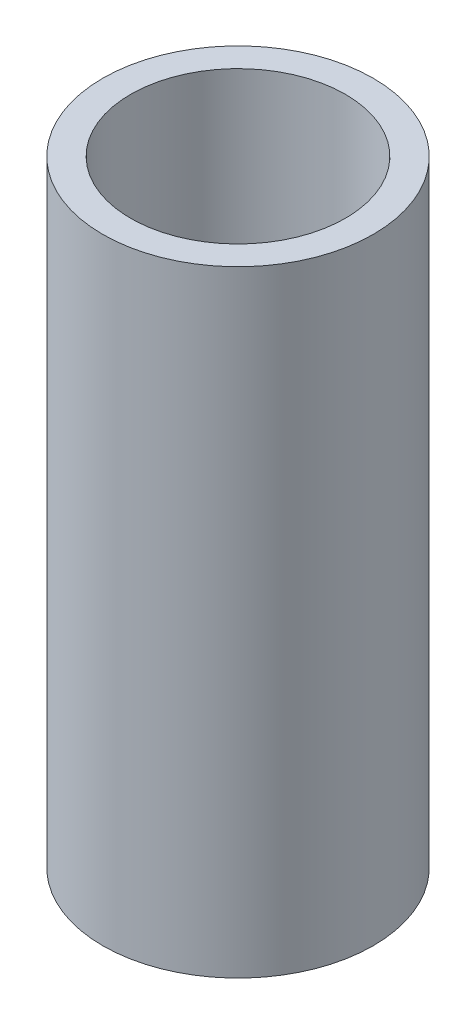
ISO-10303-21;
HEADER;
FILE_DESCRIPTION(('STEP AP214'),'2;1');
FILE_NAME('part.step','',(''),(''),'','','');
FILE_SCHEMA(('AUTOMOTIVE_DESIGN { 1 0 10303 214 1 1 1 1 }'));
ENDSEC;
DATA;
#1=APPLICATION_CONTEXT('core data for automotive mechanical design processes');
#2=APPLICATION_PROTOCOL_DEFINITION('international standard','automotive_design',2000,#1);
#3=PRODUCT_CONTEXT('',#1,'mechanical');
#4=PRODUCT('Part','Part','',(#3));
#5=PRODUCT_RELATED_PRODUCT_CATEGORY('part','',(#4));
#6=PRODUCT_DEFINITION_FORMATION('','',#4);
#7=PRODUCT_DEFINITION_CONTEXT('part definition',#1,'design');
#8=PRODUCT_DEFINITION('design','',#6,#7);
#9=PRODUCT_DEFINITION_SHAPE('','',#8);
#10=(LENGTH_UNIT() NAMED_UNIT(*) SI_UNIT(.MILLI.,.METRE.));
#11=(NAMED_UNIT(*) PLANE_ANGLE_UNIT() SI_UNIT($,.RADIAN.));
#12=(NAMED_UNIT(*) SI_UNIT($,.STERADIAN.) SOLID_ANGLE_UNIT());
#13=UNCERTAINTY_MEASURE_WITH_UNIT(LENGTH_MEASURE(1.E-05),#10,'distance_accuracy_value','');
#14=(GEOMETRIC_REPRESENTATION_CONTEXT(3) GLOBAL_UNCERTAINTY_ASSIGNED_CONTEXT((#13)) GLOBAL_UNIT_ASSIGNED_CONTEXT((#10,
#11,#12)) REPRESENTATION_CONTEXT('',''));
#15=CARTESIAN_POINT('',(0.,0.,0.));
#16=DIRECTION('',(0.,0.,1.));
#17=DIRECTION('',(1.,0.,0.));
#18=AXIS2_PLACEMENT_3D('',#15,#16,#17);
#19=CARTESIAN_POINT('',(0.,113.879755640342,0.));
#20=DIRECTION('',(0.,-1.,0.));
#21=DIRECTION('',(0.,0.,-1.));
#22=AXIS2_PLACEMENT_3D('',#19,#20,#21);
#23=CYLINDRICAL_SURFACE('',#22,25.);
#24=CARTESIAN_POINT('',(0.,113.879755640342,0.));
#25=DIRECTION('',(0.,1.,0.));
#26=DIRECTION('',(0.,0.,1.));
#27=AXIS2_PLACEMENT_3D('',#24,#25,#26);
#28=CIRCLE('',#27,25.);
#29=CARTESIAN_POINT('',(0.,113.879755640342,-25.));
#30=VERTEX_POINT('',#29);
#31=EDGE_CURVE('E10',#30,#30,#28,.T.);
#32=CARTESIAN_POINT('',(0.,0.,0.));
#33=DIRECTION('',(0.,1.,0.));
#34=DIRECTION('',(0.,0.,1.));
#35=AXIS2_PLACEMENT_3D('',#32,#33,#34);
#36=CIRCLE('',#35,25.);
#37=CARTESIAN_POINT('',(0.,0.,-25.));
#38=VERTEX_POINT('',#37);
#39=EDGE_CURVE('E37',#38,#38,#36,.T.);
#40=CARTESIAN_POINT('',(0.,113.879755640342,-25.));
#41=CARTESIAN_POINT('',(0.,112.693508185755,-25.));
#42=CARTESIAN_POINT('',(0.,111.507260731168,-25.));
#43=CARTESIAN_POINT('',(0.,109.134765821994,-25.));
#44=CARTESIAN_POINT('',(0.,107.948518367407,-25.));
#45=CARTESIAN_POINT('',(0.,105.576023458234,-25.));
#46=CARTESIAN_POINT('',(0.,104.389776003647,-25.));
#47=CARTESIAN_POINT('',(0.,102.017281094473,-25.));
#48=CARTESIAN_POINT('',(0.,100.831033639886,-25.));
#49=CARTESIAN_POINT('',(0.,98.4585387307121,-25.));
#50=CARTESIAN_POINT('',(0.,97.2722912761253,-25.));
#51=CARTESIAN_POINT('',(0.,94.8997963669515,-25.));
#52=CARTESIAN_POINT('',(0.,93.7135489123646,-25.));
#53=CARTESIAN_POINT('',(0.,91.3410540031908,-25.));
#54=CARTESIAN_POINT('',(0.,90.1548065486039,-25.));
#55=CARTESIAN_POINT('',(0.,87.7823116394301,-25.));
#56=CARTESIAN_POINT('',(0.,86.5960641848432,-25.));
#57=CARTESIAN_POINT('',(0.,84.2235692756694,-25.));
#58=CARTESIAN_POINT('',(0.,83.0373218210825,-25.));
#59=CARTESIAN_POINT('',(0.,80.6648269119087,-25.));
#60=CARTESIAN_POINT('',(0.,79.4785794573219,-25.));
#61=CARTESIAN_POINT('',(0.,77.1060845481481,-25.));
#62=CARTESIAN_POINT('',(0.,75.9198370935612,-25.));
#63=CARTESIAN_POINT('',(0.,73.5473421843874,-25.));
#64=CARTESIAN_POINT('',(0.,72.3610947298005,-25.));
#65=CARTESIAN_POINT('',(0.,69.9885998206267,-25.));
#66=CARTESIAN_POINT('',(0.,68.8023523660398,-25.));
#67=CARTESIAN_POINT('',(0.,66.429857456866,-25.));
#68=CARTESIAN_POINT('',(0.,65.2436100022791,-25.));
#69=CARTESIAN_POINT('',(0.,62.8711150931053,-25.));
#70=CARTESIAN_POINT('',(0.,61.6848676385185,-25.));
#71=CARTESIAN_POINT('',(0.,59.3123727293447,-25.));
#72=CARTESIAN_POINT('',(0.,58.1261252747578,-25.));
#73=CARTESIAN_POINT('',(0.,55.753630365584,-25.));
#74=CARTESIAN_POINT('',(0.,54.5673829109971,-25.));
#75=CARTESIAN_POINT('',(0.,52.1948880018233,-25.));
#76=CARTESIAN_POINT('',(0.,51.0086405472364,-25.));
#77=CARTESIAN_POINT('',(0.,48.6361456380626,-25.));
#78=CARTESIAN_POINT('',(0.,47.4498981834757,-25.));
#79=CARTESIAN_POINT('',(0.,45.077403274302,-25.));
#80=CARTESIAN_POINT('',(0.,43.8911558197151,-25.));
#81=CARTESIAN_POINT('',(0.,41.5186609105413,-25.));
#82=CARTESIAN_POINT('',(0.,40.3324134559544,-25.));
#83=CARTESIAN_POINT('',(0.,37.9599185467806,-25.));
#84=CARTESIAN_POINT('',(0.,36.7736710921937,-25.));
#85=CARTESIAN_POINT('',(0.,34.4011761830199,-25.));
#86=CARTESIAN_POINT('',(0.,33.214928728433,-25.));
#87=CARTESIAN_POINT('',(0.,30.8424338192592,-25.));
#88=CARTESIAN_POINT('',(0.,29.6561863646723,-25.));
#89=CARTESIAN_POINT('',(0.,27.2836914554985,-25.));
#90=CARTESIAN_POINT('',(0.,26.0974440009117,-25.));
#91=CARTESIAN_POINT('',(0.,23.7249490917379,-25.));
#92=CARTESIAN_POINT('',(0.,22.538701637151,-25.));
#93=CARTESIAN_POINT('',(0.,20.1662067279772,-25.));
#94=CARTESIAN_POINT('',(0.,18.9799592733903,-25.));
#95=CARTESIAN_POINT('',(0.,16.6074643642165,-25.));
#96=CARTESIAN_POINT('',(0.,15.4212169096296,-25.));
#97=CARTESIAN_POINT('',(0.,13.0487220004558,-25.));
#98=CARTESIAN_POINT('',(0.,11.8624745458689,-25.));
#99=CARTESIAN_POINT('',(0.,9.48997963669514,-25.));
#100=CARTESIAN_POINT('',(0.,8.30373218210824,-25.));
#101=CARTESIAN_POINT('',(0.,5.93123727293445,-25.));
#102=CARTESIAN_POINT('',(0.,4.74498981834756,-25.));
#103=CARTESIAN_POINT('',(0.,2.37249490917377,-25.));
#104=CARTESIAN_POINT('',(0.,1.18624745458688,-25.));
#105=CARTESIAN_POINT('',(0.,0.,-25.));
#106=B_SPLINE_CURVE_WITH_KNOTS('',3,(#40,#41,#42,#43,#44,#45,#46,#47,#48,#49,#50,#51,#52,#53,
#54,#55,#56,#57,#58,#59,#60,#61,#62,#63,#64,#65,#66,#67,#68,#69,#70,#71,#72,#73,#74,#75,#76,#77,
#78,#79,#80,#81,#82,#83,#84,#85,#86,#87,#88,#89,#90,#91,#92,#93,#94,#95,#96,#97,#98,#99,#100,
#101,#102,#103,#104,#105),.UNSPECIFIED.,.F.,.F.,(4,2,2,2,2,2,2,2,2,2,2,2,2,2,2,2,2,2,2,2,2,2,2,
2,2,2,2,2,2,2,2,2,4),(0.,3.55874236376068,7.11748472752136,10.676227091282,14.2349694550427,
17.7937118188034,21.3524541825641,24.9111965463248,28.4699389100854,32.0286812738461,
35.5874236376068,39.1461660013675,42.7049083651281,46.2636507288888,49.8223930926495,
53.3811354564102,56.9398778201709,60.4986201839316,64.0573625476923,67.6161049114529,
71.1748472752136,74.7335896389743,78.292332002735,81.8510743664957,85.4098167302563,
88.968559094017,92.5273014577777,96.0860438215384,99.6447861852991,103.20352854906,
106.76227091282,110.321013276581,113.879755640342),.UNSPECIFIED.);
#107=EDGE_CURVE('BSEAM40',#30,#38,#106,.T.);
#108=ORIENTED_EDGE('',*,*,#31,.F.);
#109=ORIENTED_EDGE('',*,*,#39,.T.);
#110=ORIENTED_EDGE('',*,*,#107,.T.);
#111=ORIENTED_EDGE('',*,*,#107,.F.);
#112=EDGE_LOOP('',(#108,#110,#109,#111));
#113=FACE_BOUND('',#112,.T.);
#114=ADVANCED_FACE('F40',(#113),#23,.T.);
#115=CARTESIAN_POINT('',(0.,113.879755640342,0.));
#116=DIRECTION('',(0.,1.,0.));
#117=DIRECTION('',(0.,0.,1.));
#118=AXIS2_PLACEMENT_3D('',#115,#116,#117);
#119=PLANE('',#118);
#120=CARTESIAN_POINT('',(0.,113.879755640342,0.));
#121=DIRECTION('',(0.,1.,0.));
#122=DIRECTION('',(0.,0.,1.));
#123=AXIS2_PLACEMENT_3D('',#120,#121,#122);
#124=CIRCLE('',#123,19.8554112487231);
#125=CARTESIAN_POINT('',(0.,113.879755640342,-19.8554112487231));
#126=VERTEX_POINT('',#125);
#127=EDGE_CURVE('E50',#126,#126,#124,.T.);
#128=ORIENTED_EDGE('',*,*,#127,.F.);
#129=EDGE_LOOP('',(#128));
#130=FACE_BOUND('',#129,.T.);
#131=ORIENTED_EDGE('',*,*,#31,.T.);
#132=EDGE_LOOP('',(#131));
#133=FACE_BOUND('',#132,.T.);
#134=ADVANCED_FACE('F59',(#130,#133),#119,.T.);
#135=CARTESIAN_POINT('',(0.,0.,0.));
#136=DIRECTION('',(0.,1.,0.));
#137=DIRECTION('',(0.,0.,1.));
#138=AXIS2_PLACEMENT_3D('',#135,#136,#137);
#139=PLANE('',#138);
#140=CARTESIAN_POINT('',(0.,0.,0.));
#141=DIRECTION('',(0.,1.,0.));
#142=DIRECTION('',(0.,0.,1.));
#143=AXIS2_PLACEMENT_3D('',#140,#141,#142);
#144=CIRCLE('',#143,19.8554112487231);
#145=CARTESIAN_POINT('',(0.,0.,-19.8554112487231));
#146=VERTEX_POINT('',#145);
#147=EDGE_CURVE('E47',#146,#146,#144,.T.);
#148=ORIENTED_EDGE('',*,*,#147,.T.);
#149=EDGE_LOOP('',(#148));
#150=FACE_BOUND('',#149,.T.);
#151=ORIENTED_EDGE('',*,*,#39,.F.);
#152=EDGE_LOOP('',(#151));
#153=FACE_BOUND('',#152,.T.);
#154=ADVANCED_FACE('F58',(#150,#153),#139,.F.);
#155=CARTESIAN_POINT('',(0.,113.879755640342,0.));
#156=DIRECTION('',(0.,-1.,0.));
#157=DIRECTION('',(0.,0.,-1.));
#158=AXIS2_PLACEMENT_3D('',#155,#156,#157);
#159=CYLINDRICAL_SURFACE('',#158,19.8554112487231);
#160=CARTESIAN_POINT('',(0.,113.879755640342,-19.8554112487231));
#161=CARTESIAN_POINT('',(0.,112.693508185755,-19.8554112487231));
#162=CARTESIAN_POINT('',(0.,111.507260731168,-19.8554112487231));
#163=CARTESIAN_POINT('',(0.,109.134765821994,-19.8554112487231));
#164=CARTESIAN_POINT('',(0.,107.948518367407,-19.8554112487231));
#165=CARTESIAN_POINT('',(0.,105.576023458234,-19.8554112487231));
#166=CARTESIAN_POINT('',(0.,104.389776003647,-19.8554112487231));
#167=CARTESIAN_POINT('',(0.,102.017281094473,-19.8554112487231));
#168=CARTESIAN_POINT('',(0.,100.831033639886,-19.8554112487231));
#169=CARTESIAN_POINT('',(0.,98.4585387307121,-19.8554112487231));
#170=CARTESIAN_POINT('',(0.,97.2722912761253,-19.8554112487231));
#171=CARTESIAN_POINT('',(0.,94.8997963669515,-19.8554112487231));
#172=CARTESIAN_POINT('',(0.,93.7135489123646,-19.8554112487231));
#173=CARTESIAN_POINT('',(0.,91.3410540031908,-19.8554112487231));
#174=CARTESIAN_POINT('',(0.,90.1548065486039,-19.8554112487231));
#175=CARTESIAN_POINT('',(0.,87.7823116394301,-19.8554112487231));
#176=CARTESIAN_POINT('',(0.,86.5960641848432,-19.8554112487231));
#177=CARTESIAN_POINT('',(0.,84.2235692756694,-19.8554112487231));
#178=CARTESIAN_POINT('',(0.,83.0373218210825,-19.8554112487231));
#179=CARTESIAN_POINT('',(0.,80.6648269119087,-19.8554112487231));
#180=CARTESIAN_POINT('',(0.,79.4785794573219,-19.8554112487231));
#181=CARTESIAN_POINT('',(0.,77.1060845481481,-19.8554112487231));
#182=CARTESIAN_POINT('',(0.,75.9198370935612,-19.8554112487231));
#183=CARTESIAN_POINT('',(0.,73.5473421843874,-19.8554112487231));
#184=CARTESIAN_POINT('',(0.,72.3610947298005,-19.8554112487231));
#185=CARTESIAN_POINT('',(0.,69.9885998206267,-19.8554112487231));
#186=CARTESIAN_POINT('',(0.,68.8023523660398,-19.8554112487231));
#187=CARTESIAN_POINT('',(0.,66.429857456866,-19.8554112487231));
#188=CARTESIAN_POINT('',(0.,65.2436100022791,-19.8554112487231));
#189=CARTESIAN_POINT('',(0.,62.8711150931053,-19.8554112487231));
#190=CARTESIAN_POINT('',(0.,61.6848676385185,-19.8554112487231));
#191=CARTESIAN_POINT('',(0.,59.3123727293447,-19.8554112487231));
#192=CARTESIAN_POINT('',(0.,58.1261252747578,-19.8554112487231));
#193=CARTESIAN_POINT('',(0.,55.753630365584,-19.8554112487231));
#194=CARTESIAN_POINT('',(0.,54.5673829109971,-19.8554112487231));
#195=CARTESIAN_POINT('',(0.,52.1948880018233,-19.8554112487231));
#196=CARTESIAN_POINT('',(0.,51.0086405472364,-19.8554112487231));
#197=CARTESIAN_POINT('',(0.,48.6361456380626,-19.8554112487231));
#198=CARTESIAN_POINT('',(0.,47.4498981834757,-19.8554112487231));
#199=CARTESIAN_POINT('',(0.,45.077403274302,-19.8554112487231));
#200=CARTESIAN_POINT('',(0.,43.8911558197151,-19.8554112487231));
#201=CARTESIAN_POINT('',(0.,41.5186609105413,-19.8554112487231));
#202=CARTESIAN_POINT('',(0.,40.3324134559544,-19.8554112487231));
#203=CARTESIAN_POINT('',(0.,37.9599185467806,-19.8554112487231));
#204=CARTESIAN_POINT('',(0.,36.7736710921937,-19.8554112487231));
#205=CARTESIAN_POINT('',(0.,34.4011761830199,-19.8554112487231));
#206=CARTESIAN_POINT('',(0.,33.214928728433,-19.8554112487231));
#207=CARTESIAN_POINT('',(0.,30.8424338192592,-19.8554112487231));
#208=CARTESIAN_POINT('',(0.,29.6561863646723,-19.8554112487231));
#209=CARTESIAN_POINT('',(0.,27.2836914554985,-19.8554112487231));
#210=CARTESIAN_POINT('',(0.,26.0974440009117,-19.8554112487231));
#211=CARTESIAN_POINT('',(0.,23.7249490917379,-19.8554112487231));
#212=CARTESIAN_POINT('',(0.,22.538701637151,-19.8554112487231));
#213=CARTESIAN_POINT('',(0.,20.1662067279772,-19.8554112487231));
#214=CARTESIAN_POINT('',(0.,18.9799592733903,-19.8554112487231));
#215=CARTESIAN_POINT('',(0.,16.6074643642165,-19.8554112487231));
#216=CARTESIAN_POINT('',(0.,15.4212169096296,-19.8554112487231));
#217=CARTESIAN_POINT('',(0.,13.0487220004558,-19.8554112487231));
#218=CARTESIAN_POINT('',(0.,11.8624745458689,-19.8554112487231));
#219=CARTESIAN_POINT('',(0.,9.48997963669514,-19.8554112487231));
#220=CARTESIAN_POINT('',(0.,8.30373218210824,-19.8554112487231));
#221=CARTESIAN_POINT('',(0.,5.93123727293445,-19.8554112487231));
#222=CARTESIAN_POINT('',(0.,4.74498981834756,-19.8554112487231));
#223=CARTESIAN_POINT('',(0.,2.37249490917377,-19.8554112487231));
#224=CARTESIAN_POINT('',(0.,1.18624745458688,-19.8554112487231));
#225=CARTESIAN_POINT('',(0.,0.,-19.8554112487231));
#226=B_SPLINE_CURVE_WITH_KNOTS('',3,(#160,#161,#162,#163,#164,#165,#166,#167,#168,#169,#170,
#171,#172,#173,#174,#175,#176,#177,#178,#179,#180,#181,#182,#183,#184,#185,#186,#187,#188,#189,
#190,#191,#192,#193,#194,#195,#196,#197,#198,#199,#200,#201,#202,#203,#204,#205,#206,#207,#208,
#209,#210,#211,#212,#213,#214,#215,#216,#217,#218,#219,#220,#221,#222,#223,#224,#225),
.UNSPECIFIED.,.F.,.F.,(4,2,2,2,2,2,2,2,2,2,2,2,2,2,2,2,2,2,2,2,2,2,2,2,2,2,2,2,2,2,2,2,4),(0.,
3.55874236376068,7.11748472752136,10.676227091282,14.2349694550427,17.7937118188034,
21.3524541825641,24.9111965463248,28.4699389100854,32.0286812738461,35.5874236376068,
39.1461660013675,42.7049083651281,46.2636507288888,49.8223930926495,53.3811354564102,
56.9398778201709,60.4986201839316,64.0573625476923,67.6161049114529,71.1748472752136,
74.7335896389743,78.292332002735,81.8510743664957,85.4098167302563,88.968559094017,
92.5273014577777,96.0860438215384,99.6447861852991,103.20352854906,106.76227091282,
110.321013276581,113.879755640342),.UNSPECIFIED.);
#227=EDGE_CURVE('BSEAM54',#126,#146,#226,.T.);
#228=ORIENTED_EDGE('',*,*,#127,.T.);
#229=ORIENTED_EDGE('',*,*,#147,.F.);
#230=ORIENTED_EDGE('',*,*,#227,.T.);
#231=ORIENTED_EDGE('',*,*,#227,.F.);
#232=EDGE_LOOP('',(#228,#230,#229,#231));
#233=FACE_BOUND('',#232,.T.);
#234=ADVANCED_FACE('F54',(#233),#159,.F.);
#235=CLOSED_SHELL('',(#114,#134,#154,#234));
#236=MANIFOLD_SOLID_BREP('B2',#235);
#237=ADVANCED_BREP_SHAPE_REPRESENTATION('',(#18,#236),#14);
#238=SHAPE_DEFINITION_REPRESENTATION(#9,#237);
ENDSEC;
END-ISO-10303-21;
